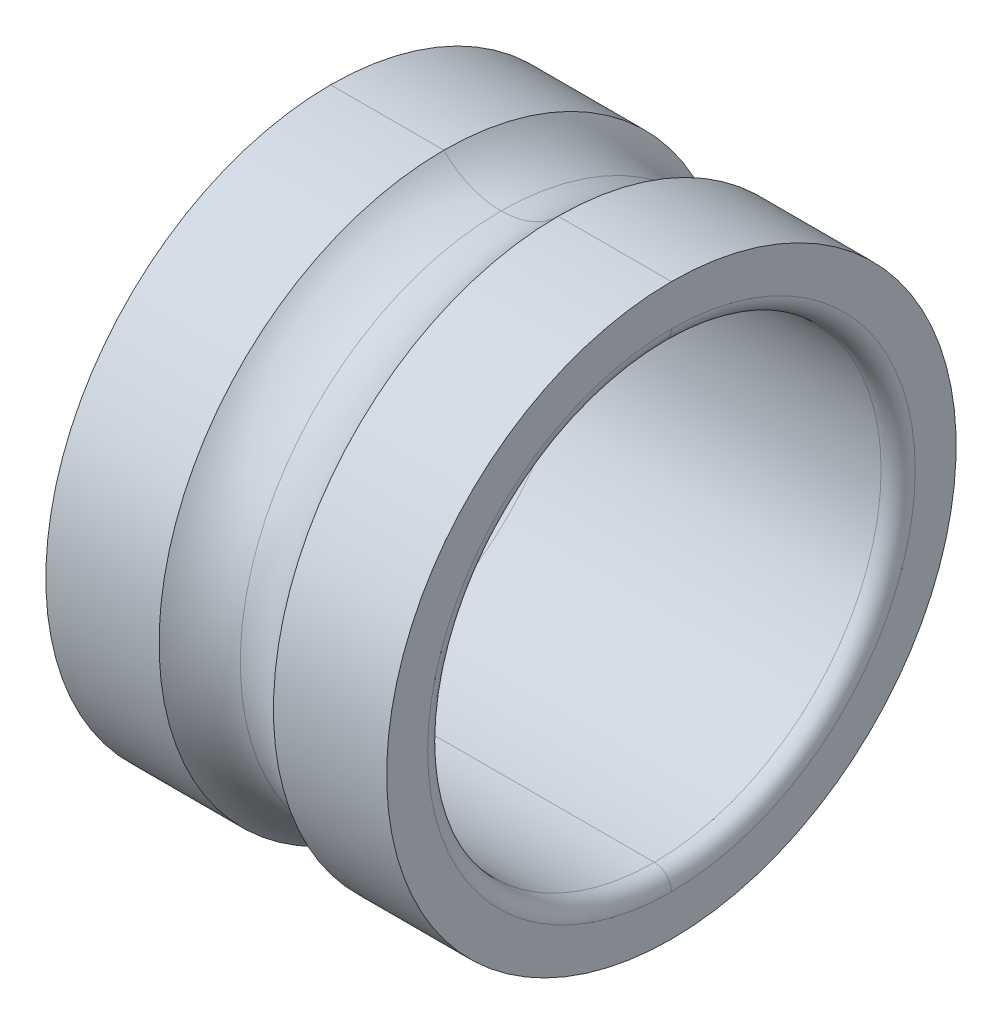
ISO-10303-21;
HEADER;
FILE_DESCRIPTION(('STEP AP214'),'2;1');
FILE_NAME('part.step','',(''),(''),'','','');
FILE_SCHEMA(('AUTOMOTIVE_DESIGN { 1 0 10303 214 1 1 1 1 }'));
ENDSEC;
DATA;
#1=APPLICATION_CONTEXT('core data for automotive mechanical design processes');
#2=APPLICATION_PROTOCOL_DEFINITION('international standard','automotive_design',2000,#1);
#3=PRODUCT_CONTEXT('',#1,'mechanical');
#4=PRODUCT('Part','Part','',(#3));
#5=PRODUCT_RELATED_PRODUCT_CATEGORY('part','',(#4));
#6=PRODUCT_DEFINITION_FORMATION('','',#4);
#7=PRODUCT_DEFINITION_CONTEXT('part definition',#1,'design');
#8=PRODUCT_DEFINITION('design','',#6,#7);
#9=PRODUCT_DEFINITION_SHAPE('','',#8);
#10=(LENGTH_UNIT() NAMED_UNIT(*) SI_UNIT(.MILLI.,.METRE.));
#11=(NAMED_UNIT(*) PLANE_ANGLE_UNIT() SI_UNIT($,.RADIAN.));
#12=(NAMED_UNIT(*) SI_UNIT($,.STERADIAN.) SOLID_ANGLE_UNIT());
#13=UNCERTAINTY_MEASURE_WITH_UNIT(LENGTH_MEASURE(1.E-05),#10,'distance_accuracy_value','');
#14=(GEOMETRIC_REPRESENTATION_CONTEXT(3) GLOBAL_UNCERTAINTY_ASSIGNED_CONTEXT((#13)) GLOBAL_UNIT_ASSIGNED_CONTEXT((#10,
#11,#12)) REPRESENTATION_CONTEXT('',''));
#15=CARTESIAN_POINT('',(0.,0.,0.));
#16=DIRECTION('',(0.,0.,1.));
#17=DIRECTION('',(1.,0.,0.));
#18=AXIS2_PLACEMENT_3D('',#15,#16,#17);
#19=CARTESIAN_POINT('',(-1.34874,0.,0.));
#20=DIRECTION('',(1.,0.,0.));
#21=DIRECTION('',(0.,-1.,0.));
#22=AXIS2_PLACEMENT_3D('',#19,#20,#21);
#23=TOROIDAL_SURFACE('',#22,2.14376,0.14986);
#24=CARTESIAN_POINT('',(-1.4986,0.,0.));
#25=DIRECTION('',(-1.,0.,0.));
#26=DIRECTION('',(0.,1.,0.));
#27=AXIS2_PLACEMENT_3D('',#24,#25,#26);
#28=CIRCLE('',#27,2.14376);
#29=CARTESIAN_POINT('',(-1.4986,2.14376,0.));
#30=VERTEX_POINT('',#29);
#31=CARTESIAN_POINT('',(-1.4986,-2.14376,0.));
#32=VERTEX_POINT('',#31);
#33=EDGE_CURVE('E196',#30,#32,#28,.T.);
#34=ORIENTED_EDGE('',*,*,#33,.T.);
#35=CARTESIAN_POINT('',(-1.34874,-2.14376,0.));
#36=DIRECTION('',(0.,0.,-1.));
#37=DIRECTION('',(-1.,0.,0.));
#38=AXIS2_PLACEMENT_3D('',#35,#36,#37);
#39=CIRCLE('',#38,0.14986);
#40=CARTESIAN_POINT('',(-1.34874,-1.9939,0.));
#41=VERTEX_POINT('',#40);
#42=EDGE_CURVE('E28',#32,#41,#39,.T.);
#43=ORIENTED_EDGE('',*,*,#42,.T.);
#44=CARTESIAN_POINT('',(-1.34874,0.,0.));
#45=DIRECTION('',(-1.,0.,0.));
#46=DIRECTION('',(0.,1.,0.));
#47=AXIS2_PLACEMENT_3D('',#44,#45,#46);
#48=CIRCLE('',#47,1.9939);
#49=CARTESIAN_POINT('',(-1.34874,1.9939,0.));
#50=VERTEX_POINT('',#49);
#51=EDGE_CURVE('E168',#50,#41,#48,.T.);
#52=ORIENTED_EDGE('',*,*,#51,.F.);
#53=CARTESIAN_POINT('',(-1.34874,2.14376,0.));
#54=DIRECTION('',(0.,0.,1.));
#55=DIRECTION('',(-1.,0.,0.));
#56=AXIS2_PLACEMENT_3D('',#53,#54,#55);
#57=CIRCLE('',#56,0.14986);
#58=EDGE_CURVE('E11',#30,#50,#57,.T.);
#59=ORIENTED_EDGE('',*,*,#58,.F.);
#60=EDGE_LOOP('',(#34,#43,#52,#59));
#61=FACE_BOUND('',#60,.T.);
#62=ADVANCED_FACE('F17',(#61),#23,.T.);
#63=CARTESIAN_POINT('',(-1.34874,0.,0.));
#64=DIRECTION('',(1.,0.,0.));
#65=DIRECTION('',(0.,-1.,0.));
#66=AXIS2_PLACEMENT_3D('',#63,#64,#65);
#67=TOROIDAL_SURFACE('',#66,2.14376,0.14986);
#68=CARTESIAN_POINT('',(-1.34874,0.,0.));
#69=DIRECTION('',(1.,0.,0.));
#70=DIRECTION('',(0.,1.,0.));
#71=AXIS2_PLACEMENT_3D('',#68,#69,#70);
#72=CIRCLE('',#71,1.9939);
#73=EDGE_CURVE('E185',#50,#41,#72,.T.);
#74=ORIENTED_EDGE('',*,*,#73,.T.);
#75=ORIENTED_EDGE('',*,*,#42,.F.);
#76=CARTESIAN_POINT('',(-1.4986,0.,0.));
#77=DIRECTION('',(1.,0.,0.));
#78=DIRECTION('',(0.,1.,0.));
#79=AXIS2_PLACEMENT_3D('',#76,#77,#78);
#80=CIRCLE('',#79,2.14376);
#81=EDGE_CURVE('E200',#30,#32,#80,.T.);
#82=ORIENTED_EDGE('',*,*,#81,.F.);
#83=ORIENTED_EDGE('',*,*,#58,.T.);
#84=EDGE_LOOP('',(#74,#75,#82,#83));
#85=FACE_BOUND('',#84,.T.);
#86=ADVANCED_FACE('F269',(#85),#67,.T.);
#87=CARTESIAN_POINT('',(-1.4986,0.,0.));
#88=DIRECTION('',(1.,0.,0.));
#89=DIRECTION('',(0.,1.,0.));
#90=AXIS2_PLACEMENT_3D('',#87,#88,#89);
#91=PLANE('',#90);
#92=ORIENTED_EDGE('',*,*,#33,.F.);
#93=ORIENTED_EDGE('',*,*,#81,.T.);
#94=EDGE_LOOP('',(#92,#93));
#95=FACE_BOUND('',#94,.T.);
#96=CARTESIAN_POINT('',(-1.4986,0.,0.));
#97=DIRECTION('',(1.,0.,0.));
#98=DIRECTION('',(0.,1.,0.));
#99=AXIS2_PLACEMENT_3D('',#96,#97,#98);
#100=CIRCLE('',#99,2.5041606);
#101=CARTESIAN_POINT('',(-1.4986,2.5041606,0.));
#102=VERTEX_POINT('',#101);
#103=CARTESIAN_POINT('',(-1.4986,-2.5041606,0.));
#104=VERTEX_POINT('',#103);
#105=EDGE_CURVE('E181',#102,#104,#100,.T.);
#106=ORIENTED_EDGE('',*,*,#105,.F.);
#107=CARTESIAN_POINT('',(-1.4986,0.,0.));
#108=DIRECTION('',(-1.,0.,0.));
#109=DIRECTION('',(0.,1.,0.));
#110=AXIS2_PLACEMENT_3D('',#107,#108,#109);
#111=CIRCLE('',#110,2.5041606);
#112=EDGE_CURVE('E80',#102,#104,#111,.T.);
#113=ORIENTED_EDGE('',*,*,#112,.T.);
#114=EDGE_LOOP('',(#106,#113));
#115=FACE_BOUND('',#114,.T.);
#116=ADVANCED_FACE('F19',(#95,#115),#91,.F.);
#117=CARTESIAN_POINT('',(-1.64846,0.,0.));
#118=DIRECTION('',(1.,0.,0.));
#119=DIRECTION('',(0.,-1.,0.));
#120=AXIS2_PLACEMENT_3D('',#117,#118,#119);
#121=CYLINDRICAL_SURFACE('',#120,2.5041606);
#122=CARTESIAN_POINT('',(-0.503000798221673,0.,0.));
#123=DIRECTION('',(-1.,0.,0.));
#124=DIRECTION('',(0.,1.,0.));
#125=AXIS2_PLACEMENT_3D('',#122,#123,#124);
#126=CIRCLE('',#125,2.5041606);
#127=CARTESIAN_POINT('',(-0.503000798221673,2.5041606,0.));
#128=VERTEX_POINT('',#127);
#129=CARTESIAN_POINT('',(-0.503000798221673,-2.5041606,0.));
#130=VERTEX_POINT('',#129);
#131=EDGE_CURVE('E130',#128,#130,#126,.T.);
#132=ORIENTED_EDGE('',*,*,#131,.T.);
#133=DIRECTION('',(-1.,0.,0.));
#134=VECTOR('',#133,1.);
#135=CARTESIAN_POINT('',(-0.503000798221673,-2.5041606,0.));
#136=LINE('',#135,#134);
#137=EDGE_CURVE('E173',#130,#104,#136,.T.);
#138=ORIENTED_EDGE('',*,*,#137,.T.);
#139=ORIENTED_EDGE('',*,*,#112,.F.);
#140=DIRECTION('',(-1.,0.,0.));
#141=VECTOR('',#140,1.);
#142=CARTESIAN_POINT('',(-0.503000798221673,2.5041606,0.));
#143=LINE('',#142,#141);
#144=EDGE_CURVE('E92',#128,#102,#143,.T.);
#145=ORIENTED_EDGE('',*,*,#144,.F.);
#146=EDGE_LOOP('',(#132,#138,#139,#145));
#147=FACE_BOUND('',#146,.T.);
#148=ADVANCED_FACE('F287',(#147),#121,.T.);
#149=CARTESIAN_POINT('',(-1.64846,0.,0.));
#150=DIRECTION('',(1.,0.,0.));
#151=DIRECTION('',(0.,-1.,0.));
#152=AXIS2_PLACEMENT_3D('',#149,#150,#151);
#153=CYLINDRICAL_SURFACE('',#152,2.5041606);
#154=ORIENTED_EDGE('',*,*,#105,.T.);
#155=ORIENTED_EDGE('',*,*,#137,.F.);
#156=CARTESIAN_POINT('',(-0.503000798221673,0.,0.));
#157=DIRECTION('',(1.,0.,0.));
#158=DIRECTION('',(0.,1.,0.));
#159=AXIS2_PLACEMENT_3D('',#156,#157,#158);
#160=CIRCLE('',#159,2.5041606);
#161=EDGE_CURVE('E126',#128,#130,#160,.T.);
#162=ORIENTED_EDGE('',*,*,#161,.F.);
#163=ORIENTED_EDGE('',*,*,#144,.T.);
#164=EDGE_LOOP('',(#154,#155,#162,#163));
#165=FACE_BOUND('',#164,.T.);
#166=ADVANCED_FACE('F283',(#165),#153,.T.);
#167=CARTESIAN_POINT('',(0.,0.,0.));
#168=DIRECTION('',(1.,0.,0.));
#169=DIRECTION('',(0.,-1.,0.));
#170=AXIS2_PLACEMENT_3D('',#167,#168,#169);
#171=TOROIDAL_SURFACE('',#170,2.9972,0.704342);
#172=CARTESIAN_POINT('',(0.,0.,0.));
#173=DIRECTION('',(1.,0.,0.));
#174=DIRECTION('',(0.,0.,-1.));
#175=AXIS2_PLACEMENT_3D('',#172,#173,#174);
#176=CIRCLE('',#175,2.292858);
#177=CARTESIAN_POINT('',(0.,2.292858,0.));
#178=VERTEX_POINT('',#177);
#179=CARTESIAN_POINT('',(0.,-2.292858,0.));
#180=VERTEX_POINT('',#179);
#181=EDGE_CURVE('E124',#178,#180,#176,.T.);
#182=ORIENTED_EDGE('',*,*,#181,.F.);
#183=CARTESIAN_POINT('',(0.,2.9972,0.));
#184=DIRECTION('',(0.,0.,-1.));
#185=DIRECTION('',(0.714142842854284,-0.7,0.));
#186=AXIS2_PLACEMENT_3D('',#183,#184,#185);
#187=CIRCLE('',#186,0.704342);
#188=EDGE_CURVE('E137',#178,#128,#187,.T.);
#189=ORIENTED_EDGE('',*,*,#188,.T.);
#190=ORIENTED_EDGE('',*,*,#161,.T.);
#191=CARTESIAN_POINT('',(0.,-2.9972,0.));
#192=DIRECTION('',(0.,0.,1.));
#193=DIRECTION('',(0.714142842854284,0.7,0.));
#194=AXIS2_PLACEMENT_3D('',#191,#192,#193);
#195=CIRCLE('',#194,0.704342);
#196=EDGE_CURVE('E119',#180,#130,#195,.T.);
#197=ORIENTED_EDGE('',*,*,#196,.F.);
#198=EDGE_LOOP('',(#182,#189,#190,#197));
#199=FACE_BOUND('',#198,.T.);
#200=ADVANCED_FACE('F121',(#199),#171,.F.);
#201=CARTESIAN_POINT('',(0.,0.,0.));
#202=DIRECTION('',(1.,0.,0.));
#203=DIRECTION('',(0.,-1.,0.));
#204=AXIS2_PLACEMENT_3D('',#201,#202,#203);
#205=TOROIDAL_SURFACE('',#204,2.9972,0.704342);
#206=CARTESIAN_POINT('',(0.,0.,0.));
#207=DIRECTION('',(1.,0.,0.));
#208=DIRECTION('',(0.,0.,-1.));
#209=AXIS2_PLACEMENT_3D('',#206,#207,#208);
#210=CIRCLE('',#209,2.292858);
#211=EDGE_CURVE('E134',#180,#178,#210,.T.);
#212=ORIENTED_EDGE('',*,*,#211,.F.);
#213=ORIENTED_EDGE('',*,*,#196,.T.);
#214=ORIENTED_EDGE('',*,*,#131,.F.);
#215=ORIENTED_EDGE('',*,*,#188,.F.);
#216=EDGE_LOOP('',(#212,#213,#214,#215));
#217=FACE_BOUND('',#216,.T.);
#218=ADVANCED_FACE('F136',(#217),#205,.F.);
#219=CARTESIAN_POINT('',(-1.64846,0.,0.));
#220=DIRECTION('',(1.,0.,0.));
#221=DIRECTION('',(0.,-1.,0.));
#222=AXIS2_PLACEMENT_3D('',#219,#220,#221);
#223=CYLINDRICAL_SURFACE('',#222,2.5041606);
#224=CARTESIAN_POINT('',(1.4986,0.,0.));
#225=DIRECTION('',(-1.,0.,0.));
#226=DIRECTION('',(0.,1.,0.));
#227=AXIS2_PLACEMENT_3D('',#224,#225,#226);
#228=CIRCLE('',#227,2.5041606);
#229=CARTESIAN_POINT('',(1.4986,2.5041606,0.));
#230=VERTEX_POINT('',#229);
#231=CARTESIAN_POINT('',(1.4986,-2.5041606,0.));
#232=VERTEX_POINT('',#231);
#233=EDGE_CURVE('E175',#230,#232,#228,.T.);
#234=ORIENTED_EDGE('',*,*,#233,.T.);
#235=DIRECTION('',(-1.,0.,0.));
#236=VECTOR('',#235,1.);
#237=CARTESIAN_POINT('',(1.4986,-2.5041606,0.));
#238=LINE('',#237,#236);
#239=CARTESIAN_POINT('',(0.503000798221672,-2.5041606,0.));
#240=VERTEX_POINT('',#239);
#241=EDGE_CURVE('E171',#232,#240,#238,.T.);
#242=ORIENTED_EDGE('',*,*,#241,.T.);
#243=CARTESIAN_POINT('',(0.503000798221673,0.,0.));
#244=DIRECTION('',(-1.,0.,0.));
#245=DIRECTION('',(0.,1.,0.));
#246=AXIS2_PLACEMENT_3D('',#243,#244,#245);
#247=CIRCLE('',#246,2.5041606);
#248=CARTESIAN_POINT('',(0.503000798221672,2.5041606,0.));
#249=VERTEX_POINT('',#248);
#250=EDGE_CURVE('E141',#249,#240,#247,.T.);
#251=ORIENTED_EDGE('',*,*,#250,.F.);
#252=DIRECTION('',(-1.,0.,0.));
#253=VECTOR('',#252,1.);
#254=CARTESIAN_POINT('',(1.4986,2.5041606,0.));
#255=LINE('',#254,#253);
#256=EDGE_CURVE('E131',#230,#249,#255,.T.);
#257=ORIENTED_EDGE('',*,*,#256,.F.);
#258=EDGE_LOOP('',(#234,#242,#251,#257));
#259=FACE_BOUND('',#258,.T.);
#260=ADVANCED_FACE('F250',(#259),#223,.T.);
#261=CARTESIAN_POINT('',(-1.64846,0.,0.));
#262=DIRECTION('',(1.,0.,0.));
#263=DIRECTION('',(0.,-1.,0.));
#264=AXIS2_PLACEMENT_3D('',#261,#262,#263);
#265=CYLINDRICAL_SURFACE('',#264,2.5041606);
#266=CARTESIAN_POINT('',(0.503000798221673,0.,0.));
#267=DIRECTION('',(1.,0.,0.));
#268=DIRECTION('',(0.,1.,0.));
#269=AXIS2_PLACEMENT_3D('',#266,#267,#268);
#270=CIRCLE('',#269,2.5041606);
#271=EDGE_CURVE('E142',#249,#240,#270,.T.);
#272=ORIENTED_EDGE('',*,*,#271,.T.);
#273=ORIENTED_EDGE('',*,*,#241,.F.);
#274=CARTESIAN_POINT('',(1.4986,0.,0.));
#275=DIRECTION('',(1.,0.,0.));
#276=DIRECTION('',(0.,1.,0.));
#277=AXIS2_PLACEMENT_3D('',#274,#275,#276);
#278=CIRCLE('',#277,2.5041606);
#279=EDGE_CURVE('E179',#230,#232,#278,.T.);
#280=ORIENTED_EDGE('',*,*,#279,.F.);
#281=ORIENTED_EDGE('',*,*,#256,.T.);
#282=EDGE_LOOP('',(#272,#273,#280,#281));
#283=FACE_BOUND('',#282,.T.);
#284=ADVANCED_FACE('F246',(#283),#265,.T.);
#285=CARTESIAN_POINT('',(1.4986,0.,0.));
#286=DIRECTION('',(1.,0.,0.));
#287=DIRECTION('',(0.,1.,0.));
#288=AXIS2_PLACEMENT_3D('',#285,#286,#287);
#289=PLANE('',#288);
#290=CARTESIAN_POINT('',(1.4986,0.,0.));
#291=DIRECTION('',(1.,0.,0.));
#292=DIRECTION('',(0.,1.,0.));
#293=AXIS2_PLACEMENT_3D('',#290,#291,#292);
#294=CIRCLE('',#293,2.14376);
#295=CARTESIAN_POINT('',(1.4986,2.14376,0.));
#296=VERTEX_POINT('',#295);
#297=CARTESIAN_POINT('',(1.4986,-2.14376,0.));
#298=VERTEX_POINT('',#297);
#299=EDGE_CURVE('E188',#296,#298,#294,.T.);
#300=ORIENTED_EDGE('',*,*,#299,.F.);
#301=CARTESIAN_POINT('',(1.4986,0.,0.));
#302=DIRECTION('',(-1.,0.,0.));
#303=DIRECTION('',(0.,1.,0.));
#304=AXIS2_PLACEMENT_3D('',#301,#302,#303);
#305=CIRCLE('',#304,2.14376);
#306=EDGE_CURVE('E180',#296,#298,#305,.T.);
#307=ORIENTED_EDGE('',*,*,#306,.T.);
#308=EDGE_LOOP('',(#300,#307));
#309=FACE_BOUND('',#308,.T.);
#310=ORIENTED_EDGE('',*,*,#233,.F.);
#311=ORIENTED_EDGE('',*,*,#279,.T.);
#312=EDGE_LOOP('',(#310,#311));
#313=FACE_BOUND('',#312,.T.);
#314=ADVANCED_FACE('F252',(#309,#313),#289,.T.);
#315=CARTESIAN_POINT('',(1.34874,0.,0.));
#316=DIRECTION('',(1.,0.,0.));
#317=DIRECTION('',(0.,-1.,0.));
#318=AXIS2_PLACEMENT_3D('',#315,#316,#317);
#319=TOROIDAL_SURFACE('',#318,2.14376,0.14986);
#320=CARTESIAN_POINT('',(1.34874,0.,0.));
#321=DIRECTION('',(-1.,0.,0.));
#322=DIRECTION('',(0.,1.,0.));
#323=AXIS2_PLACEMENT_3D('',#320,#321,#322);
#324=CIRCLE('',#323,1.9939);
#325=CARTESIAN_POINT('',(1.34874,1.9939,0.));
#326=VERTEX_POINT('',#325);
#327=CARTESIAN_POINT('',(1.34874,-1.9939,0.));
#328=VERTEX_POINT('',#327);
#329=EDGE_CURVE('E208',#326,#328,#324,.T.);
#330=ORIENTED_EDGE('',*,*,#329,.T.);
#331=CARTESIAN_POINT('',(1.34874,-2.14376,0.));
#332=DIRECTION('',(0.,0.,-1.));
#333=DIRECTION('',(0.,1.,0.));
#334=AXIS2_PLACEMENT_3D('',#331,#332,#333);
#335=CIRCLE('',#334,0.14986);
#336=EDGE_CURVE('E195',#328,#298,#335,.T.);
#337=ORIENTED_EDGE('',*,*,#336,.T.);
#338=ORIENTED_EDGE('',*,*,#306,.F.);
#339=CARTESIAN_POINT('',(1.34874,2.14376,0.));
#340=DIRECTION('',(0.,0.,1.));
#341=DIRECTION('',(0.,-1.,0.));
#342=AXIS2_PLACEMENT_3D('',#339,#340,#341);
#343=CIRCLE('',#342,0.14986);
#344=EDGE_CURVE('E21',#326,#296,#343,.T.);
#345=ORIENTED_EDGE('',*,*,#344,.F.);
#346=EDGE_LOOP('',(#330,#337,#338,#345));
#347=FACE_BOUND('',#346,.T.);
#348=ADVANCED_FACE('F254',(#347),#319,.T.);
#349=CARTESIAN_POINT('',(1.34874,0.,0.));
#350=DIRECTION('',(1.,0.,0.));
#351=DIRECTION('',(0.,-1.,0.));
#352=AXIS2_PLACEMENT_3D('',#349,#350,#351);
#353=TOROIDAL_SURFACE('',#352,2.14376,0.14986);
#354=ORIENTED_EDGE('',*,*,#299,.T.);
#355=ORIENTED_EDGE('',*,*,#336,.F.);
#356=CARTESIAN_POINT('',(1.34874,0.,0.));
#357=DIRECTION('',(1.,0.,0.));
#358=DIRECTION('',(0.,1.,0.));
#359=AXIS2_PLACEMENT_3D('',#356,#357,#358);
#360=CIRCLE('',#359,1.9939);
#361=EDGE_CURVE('E189',#326,#328,#360,.T.);
#362=ORIENTED_EDGE('',*,*,#361,.F.);
#363=ORIENTED_EDGE('',*,*,#344,.T.);
#364=EDGE_LOOP('',(#354,#355,#362,#363));
#365=FACE_BOUND('',#364,.T.);
#366=ADVANCED_FACE('F262',(#365),#353,.T.);
#367=CARTESIAN_POINT('',(-1.64846,0.,0.));
#368=DIRECTION('',(1.,0.,0.));
#369=DIRECTION('',(0.,-1.,0.));
#370=AXIS2_PLACEMENT_3D('',#367,#368,#369);
#371=CYLINDRICAL_SURFACE('',#370,1.9939);
#372=ORIENTED_EDGE('',*,*,#361,.T.);
#373=DIRECTION('',(1.,0.,0.));
#374=VECTOR('',#373,1.);
#375=CARTESIAN_POINT('',(-1.34874,-1.9939,0.));
#376=LINE('',#375,#374);
#377=EDGE_CURVE('E217',#41,#328,#376,.T.);
#378=ORIENTED_EDGE('',*,*,#377,.F.);
#379=ORIENTED_EDGE('',*,*,#73,.F.);
#380=DIRECTION('',(1.,0.,0.));
#381=VECTOR('',#380,1.);
#382=CARTESIAN_POINT('',(-1.34874,1.9939,0.));
#383=LINE('',#382,#381);
#384=EDGE_CURVE('E204',#50,#326,#383,.T.);
#385=ORIENTED_EDGE('',*,*,#384,.T.);
#386=EDGE_LOOP('',(#372,#378,#379,#385));
#387=FACE_BOUND('',#386,.T.);
#388=ADVANCED_FACE('F279',(#387),#371,.F.);
#389=CARTESIAN_POINT('',(-1.64846,0.,0.));
#390=DIRECTION('',(1.,0.,0.));
#391=DIRECTION('',(0.,-1.,0.));
#392=AXIS2_PLACEMENT_3D('',#389,#390,#391);
#393=CYLINDRICAL_SURFACE('',#392,1.9939);
#394=ORIENTED_EDGE('',*,*,#51,.T.);
#395=ORIENTED_EDGE('',*,*,#377,.T.);
#396=ORIENTED_EDGE('',*,*,#329,.F.);
#397=ORIENTED_EDGE('',*,*,#384,.F.);
#398=EDGE_LOOP('',(#394,#395,#396,#397));
#399=FACE_BOUND('',#398,.T.);
#400=ADVANCED_FACE('F276',(#399),#393,.F.);
#401=CARTESIAN_POINT('',(0.,0.,0.));
#402=DIRECTION('',(1.,0.,0.));
#403=DIRECTION('',(0.,-1.,0.));
#404=AXIS2_PLACEMENT_3D('',#401,#402,#403);
#405=TOROIDAL_SURFACE('',#404,2.9972,0.704342);
#406=CARTESIAN_POINT('',(0.,-2.9972,0.));
#407=DIRECTION('',(0.,0.,1.));
#408=DIRECTION('',(0.714142842854284,0.7,0.));
#409=AXIS2_PLACEMENT_3D('',#406,#407,#408);
#410=CIRCLE('',#409,0.704342);
#411=EDGE_CURVE('E146',#240,#180,#410,.T.);
#412=ORIENTED_EDGE('',*,*,#411,.T.);
#413=ORIENTED_EDGE('',*,*,#211,.T.);
#414=CARTESIAN_POINT('',(0.,2.9972,0.));
#415=DIRECTION('',(0.,0.,-1.));
#416=DIRECTION('',(0.714142842854284,-0.7,0.));
#417=AXIS2_PLACEMENT_3D('',#414,#415,#416);
#418=CIRCLE('',#417,0.704342);
#419=EDGE_CURVE('E155',#249,#178,#418,.T.);
#420=ORIENTED_EDGE('',*,*,#419,.F.);
#421=ORIENTED_EDGE('',*,*,#250,.T.);
#422=EDGE_LOOP('',(#412,#413,#420,#421));
#423=FACE_BOUND('',#422,.T.);
#424=ADVANCED_FACE('F147',(#423),#405,.F.);
#425=CARTESIAN_POINT('',(0.,0.,0.));
#426=DIRECTION('',(1.,0.,0.));
#427=DIRECTION('',(0.,-1.,0.));
#428=AXIS2_PLACEMENT_3D('',#425,#426,#427);
#429=TOROIDAL_SURFACE('',#428,2.9972,0.704342);
#430=ORIENTED_EDGE('',*,*,#419,.T.);
#431=ORIENTED_EDGE('',*,*,#181,.T.);
#432=ORIENTED_EDGE('',*,*,#411,.F.);
#433=ORIENTED_EDGE('',*,*,#271,.F.);
#434=EDGE_LOOP('',(#430,#431,#432,#433));
#435=FACE_BOUND('',#434,.T.);
#436=ADVANCED_FACE('F154',(#435),#429,.F.);
#437=CLOSED_SHELL('',(#62,#86,#116,#148,#166,#200,#218,#260,#284,#314,#348,#366,#388,#400,#424,#436));
#438=MANIFOLD_SOLID_BREP('B1',#437);
#439=ADVANCED_BREP_SHAPE_REPRESENTATION('',(#18,#438),#14);
#440=SHAPE_DEFINITION_REPRESENTATION(#9,#439);
ENDSEC;
END-ISO-10303-21;
